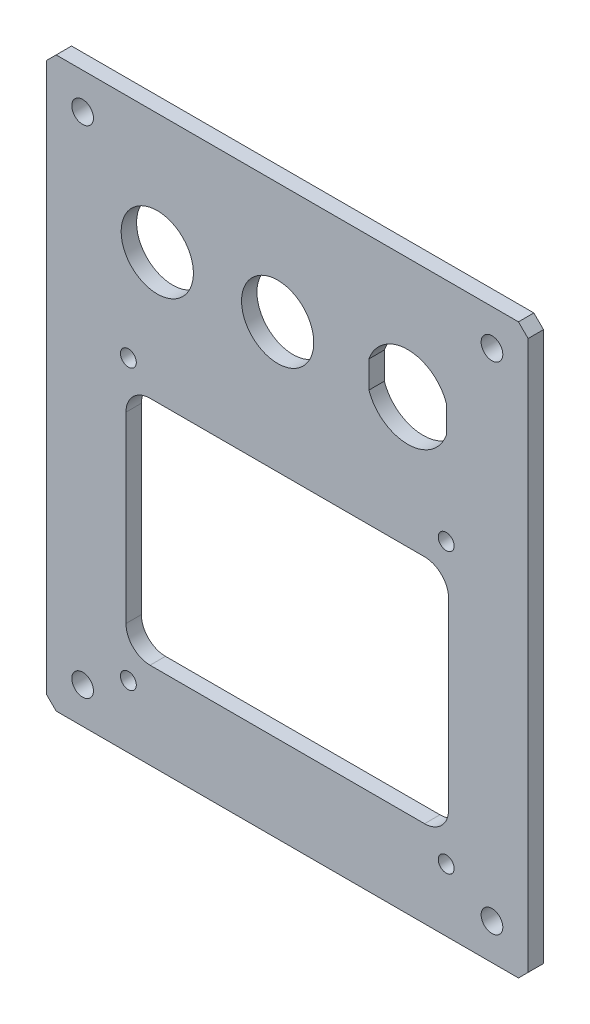
ISO-10303-21;
HEADER;
FILE_DESCRIPTION(('STEP AP214'),'2;1');
FILE_NAME('part.step','',(''),(''),'','','');
FILE_SCHEMA(('AUTOMOTIVE_DESIGN { 1 0 10303 214 1 1 1 1 }'));
ENDSEC;
DATA;
#1=APPLICATION_CONTEXT('core data for automotive mechanical design processes');
#2=APPLICATION_PROTOCOL_DEFINITION('international standard','automotive_design',2000,#1);
#3=PRODUCT_CONTEXT('',#1,'mechanical');
#4=PRODUCT('Part','Part','',(#3));
#5=PRODUCT_RELATED_PRODUCT_CATEGORY('part','',(#4));
#6=PRODUCT_DEFINITION_FORMATION('','',#4);
#7=PRODUCT_DEFINITION_CONTEXT('part definition',#1,'design');
#8=PRODUCT_DEFINITION('design','',#6,#7);
#9=PRODUCT_DEFINITION_SHAPE('','',#8);
#10=(LENGTH_UNIT() NAMED_UNIT(*) SI_UNIT(.MILLI.,.METRE.));
#11=(NAMED_UNIT(*) PLANE_ANGLE_UNIT() SI_UNIT($,.RADIAN.));
#12=(NAMED_UNIT(*) SI_UNIT($,.STERADIAN.) SOLID_ANGLE_UNIT());
#13=UNCERTAINTY_MEASURE_WITH_UNIT(LENGTH_MEASURE(1.E-05),#10,'distance_accuracy_value','');
#14=(GEOMETRIC_REPRESENTATION_CONTEXT(3) GLOBAL_UNCERTAINTY_ASSIGNED_CONTEXT((#13)) GLOBAL_UNIT_ASSIGNED_CONTEXT((#10,
#11,#12)) REPRESENTATION_CONTEXT('',''));
#15=CARTESIAN_POINT('',(0.,0.,0.));
#16=DIRECTION('',(0.,0.,1.));
#17=DIRECTION('',(1.,0.,0.));
#18=AXIS2_PLACEMENT_3D('',#15,#16,#17);
#19=CARTESIAN_POINT('',(0.,0.,1.2));
#20=DIRECTION('',(0.,0.,1.));
#21=DIRECTION('',(1.,0.,0.));
#22=AXIS2_PLACEMENT_3D('',#19,#20,#21);
#23=PLANE('',#22);
#24=CARTESIAN_POINT('',(-2.,34.,1.2));
#25=DIRECTION('',(0.,0.,-1.));
#26=DIRECTION('',(-1.,0.,0.));
#27=AXIS2_PLACEMENT_3D('',#24,#25,#26);
#28=CIRCLE('',#27,7.5);
#29=CARTESIAN_POINT('',(-9.5,34.,1.2));
#30=VERTEX_POINT('',#29);
#31=EDGE_CURVE('E265',#30,#30,#28,.F.);
#32=ORIENTED_EDGE('',*,*,#31,.T.);
#33=EDGE_LOOP('',(#32));
#34=FACE_BOUND('',#33,.T.);
#35=DIRECTION('',(1.,0.,0.));
#36=VECTOR('',#35,1.);
#37=CARTESIAN_POINT('',(-33.5,-41.,1.2));
#38=LINE('',#37,#36);
#39=CARTESIAN_POINT('',(-28.5,-41.,1.2));
#40=VERTEX_POINT('',#39);
#41=CARTESIAN_POINT('',(28.5,-41.,1.2));
#42=VERTEX_POINT('',#41);
#43=EDGE_CURVE('E174',#40,#42,#38,.T.);
#44=ORIENTED_EDGE('',*,*,#43,.T.);
#45=CARTESIAN_POINT('',(28.5,-36.,1.2));
#46=DIRECTION('',(0.,0.,-1.));
#47=DIRECTION('',(-1.,0.,0.));
#48=AXIS2_PLACEMENT_3D('',#45,#46,#47);
#49=CIRCLE('',#48,5.);
#50=CARTESIAN_POINT('',(33.5,-36.,1.2));
#51=VERTEX_POINT('',#50);
#52=EDGE_CURVE('E248',#42,#51,#49,.F.);
#53=ORIENTED_EDGE('',*,*,#52,.T.);
#54=DIRECTION('',(0.,1.,0.));
#55=VECTOR('',#54,1.);
#56=CARTESIAN_POINT('',(33.5,-41.,1.2));
#57=LINE('',#56,#55);
#58=CARTESIAN_POINT('',(33.5,2.,1.2));
#59=VERTEX_POINT('',#58);
#60=EDGE_CURVE('E178',#51,#59,#57,.T.);
#61=ORIENTED_EDGE('',*,*,#60,.T.);
#62=CARTESIAN_POINT('',(28.5,2.,1.2));
#63=DIRECTION('',(0.,0.,-1.));
#64=DIRECTION('',(-1.,0.,0.));
#65=AXIS2_PLACEMENT_3D('',#62,#63,#64);
#66=CIRCLE('',#65,5.);
#67=CARTESIAN_POINT('',(28.5,7.,1.2));
#68=VERTEX_POINT('',#67);
#69=EDGE_CURVE('E250',#59,#68,#66,.F.);
#70=ORIENTED_EDGE('',*,*,#69,.T.);
#71=DIRECTION('',(1.,0.,0.));
#72=VECTOR('',#71,1.);
#73=CARTESIAN_POINT('',(33.5,7.,1.2));
#74=LINE('',#73,#72);
#75=CARTESIAN_POINT('',(-28.5,7.,1.2));
#76=VERTEX_POINT('',#75);
#77=EDGE_CURVE('E182',#68,#76,#74,.F.);
#78=ORIENTED_EDGE('',*,*,#77,.T.);
#79=CARTESIAN_POINT('',(-28.5,2.,1.2));
#80=DIRECTION('',(0.,0.,-1.));
#81=DIRECTION('',(-1.,0.,0.));
#82=AXIS2_PLACEMENT_3D('',#79,#80,#81);
#83=CIRCLE('',#82,5.);
#84=CARTESIAN_POINT('',(-33.5,2.,1.2));
#85=VERTEX_POINT('',#84);
#86=EDGE_CURVE('E185',#76,#85,#83,.F.);
#87=ORIENTED_EDGE('',*,*,#86,.T.);
#88=DIRECTION('',(0.,1.,0.));
#89=VECTOR('',#88,1.);
#90=CARTESIAN_POINT('',(-33.5,7.,1.2));
#91=LINE('',#90,#89);
#92=CARTESIAN_POINT('',(-33.5,-36.,1.2));
#93=VERTEX_POINT('',#92);
#94=EDGE_CURVE('E171',#85,#93,#91,.F.);
#95=ORIENTED_EDGE('',*,*,#94,.T.);
#96=CARTESIAN_POINT('',(-28.5,-36.,1.2));
#97=DIRECTION('',(0.,0.,-1.));
#98=DIRECTION('',(-1.,0.,0.));
#99=AXIS2_PLACEMENT_3D('',#96,#97,#98);
#100=CIRCLE('',#99,5.);
#101=EDGE_CURVE('E246',#93,#40,#100,.F.);
#102=ORIENTED_EDGE('',*,*,#101,.T.);
#103=EDGE_LOOP('',(#44,#53,#61,#70,#78,#87,#95,#102));
#104=FACE_BOUND('',#103,.T.);
#105=CARTESIAN_POINT('',(33.,12.,1.2));
#106=DIRECTION('',(0.,0.,1.));
#107=DIRECTION('',(1.,0.,0.));
#108=AXIS2_PLACEMENT_3D('',#105,#106,#107);
#109=CIRCLE('',#108,1.65);
#110=CARTESIAN_POINT('',(34.65,12.,1.2));
#111=VERTEX_POINT('',#110);
#112=EDGE_CURVE('E253',#111,#111,#109,.T.);
#113=ORIENTED_EDGE('',*,*,#112,.T.);
#114=EDGE_LOOP('',(#113));
#115=FACE_BOUND('',#114,.T.);
#116=CARTESIAN_POINT('',(-33.,12.,1.2));
#117=DIRECTION('',(0.,0.,1.));
#118=DIRECTION('',(1.,0.,0.));
#119=AXIS2_PLACEMENT_3D('',#116,#117,#118);
#120=CIRCLE('',#119,1.65);
#121=CARTESIAN_POINT('',(-31.35,12.,1.2));
#122=VERTEX_POINT('',#121);
#123=EDGE_CURVE('E256',#122,#122,#120,.T.);
#124=ORIENTED_EDGE('',*,*,#123,.T.);
#125=EDGE_LOOP('',(#124));
#126=FACE_BOUND('',#125,.T.);
#127=CARTESIAN_POINT('',(-27.,34.,1.2));
#128=DIRECTION('',(0.,0.,-1.));
#129=DIRECTION('',(-1.,0.,0.));
#130=AXIS2_PLACEMENT_3D('',#127,#128,#129);
#131=CIRCLE('',#130,7.5);
#132=CARTESIAN_POINT('',(-34.5,34.,1.2));
#133=VERTEX_POINT('',#132);
#134=EDGE_CURVE('E268',#133,#133,#131,.F.);
#135=ORIENTED_EDGE('',*,*,#134,.T.);
#136=EDGE_LOOP('',(#135));
#137=FACE_BOUND('',#136,.T.);
#138=DIRECTION('',(0.,1.,0.));
#139=VECTOR('',#138,1.);
#140=CARTESIAN_POINT('',(33.05,31.19409105636,1.2));
#141=LINE('',#140,#139);
#142=CARTESIAN_POINT('',(33.05,31.1940910563599,1.2));
#143=VERTEX_POINT('',#142);
#144=CARTESIAN_POINT('',(33.05,36.8059089436401,1.2));
#145=VERTEX_POINT('',#144);
#146=EDGE_CURVE('E107',#143,#145,#141,.T.);
#147=ORIENTED_EDGE('',*,*,#146,.T.);
#148=CARTESIAN_POINT('',(25.,34.,1.2));
#149=DIRECTION('',(0.,0.,1.));
#150=DIRECTION('',(1.,0.,0.));
#151=AXIS2_PLACEMENT_3D('',#148,#149,#150);
#152=CIRCLE('',#151,8.525);
#153=CARTESIAN_POINT('',(16.95,36.8059089436401,1.2));
#154=VERTEX_POINT('',#153);
#155=EDGE_CURVE('E192',#145,#154,#152,.T.);
#156=ORIENTED_EDGE('',*,*,#155,.T.);
#157=DIRECTION('',(0.,1.,0.));
#158=VECTOR('',#157,1.);
#159=CARTESIAN_POINT('',(16.95,36.80590894364,1.2));
#160=LINE('',#159,#158);
#161=CARTESIAN_POINT('',(16.95,31.1940910563599,1.2));
#162=VERTEX_POINT('',#161);
#163=EDGE_CURVE('E186',#154,#162,#160,.F.);
#164=ORIENTED_EDGE('',*,*,#163,.T.);
#165=CARTESIAN_POINT('',(25.,34.,1.2));
#166=DIRECTION('',(0.,0.,1.));
#167=DIRECTION('',(1.,0.,0.));
#168=AXIS2_PLACEMENT_3D('',#165,#166,#167);
#169=CIRCLE('',#168,8.525);
#170=EDGE_CURVE('E272',#162,#143,#169,.T.);
#171=ORIENTED_EDGE('',*,*,#170,.T.);
#172=EDGE_LOOP('',(#147,#156,#164,#171));
#173=FACE_BOUND('',#172,.T.);
#174=CARTESIAN_POINT('',(33.,-46.,1.2));
#175=DIRECTION('',(0.,0.,1.));
#176=DIRECTION('',(1.,0.,0.));
#177=AXIS2_PLACEMENT_3D('',#174,#175,#176);
#178=CIRCLE('',#177,1.65);
#179=CARTESIAN_POINT('',(34.65,-46.,1.2));
#180=VERTEX_POINT('',#179);
#181=EDGE_CURVE('E259',#180,#180,#178,.T.);
#182=ORIENTED_EDGE('',*,*,#181,.T.);
#183=EDGE_LOOP('',(#182));
#184=FACE_BOUND('',#183,.T.);
#185=CARTESIAN_POINT('',(-33.,-46.,1.2));
#186=DIRECTION('',(0.,0.,1.));
#187=DIRECTION('',(1.,0.,0.));
#188=AXIS2_PLACEMENT_3D('',#185,#186,#187);
#189=CIRCLE('',#188,1.65);
#190=CARTESIAN_POINT('',(-31.35,-46.,1.2));
#191=VERTEX_POINT('',#190);
#192=EDGE_CURVE('E262',#191,#191,#189,.T.);
#193=ORIENTED_EDGE('',*,*,#192,.T.);
#194=EDGE_LOOP('',(#193));
#195=FACE_BOUND('',#194,.T.);
#196=CARTESIAN_POINT('',(-42.5,-51.5,1.2));
#197=DIRECTION('',(0.,0.,-1.));
#198=DIRECTION('',(-1.,0.,0.));
#199=AXIS2_PLACEMENT_3D('',#196,#197,#198);
#200=CIRCLE('',#199,2.25);
#201=CARTESIAN_POINT('',(-44.75,-51.5,1.2));
#202=VERTEX_POINT('',#201);
#203=EDGE_CURVE('E19',#202,#202,#200,.F.);
#204=ORIENTED_EDGE('',*,*,#203,.T.);
#205=EDGE_LOOP('',(#204));
#206=FACE_BOUND('',#205,.T.);
#207=CARTESIAN_POINT('',(42.5,-51.5,1.2));
#208=DIRECTION('',(0.,0.,-1.));
#209=DIRECTION('',(-1.,0.,0.));
#210=AXIS2_PLACEMENT_3D('',#207,#208,#209);
#211=CIRCLE('',#210,2.25);
#212=CARTESIAN_POINT('',(40.25,-51.5,1.2));
#213=VERTEX_POINT('',#212);
#214=EDGE_CURVE('E280',#213,#213,#211,.F.);
#215=ORIENTED_EDGE('',*,*,#214,.T.);
#216=EDGE_LOOP('',(#215));
#217=FACE_BOUND('',#216,.T.);
#218=CARTESIAN_POINT('',(-42.5,51.5,1.2));
#219=DIRECTION('',(0.,0.,-1.));
#220=DIRECTION('',(-1.,0.,0.));
#221=AXIS2_PLACEMENT_3D('',#218,#219,#220);
#222=CIRCLE('',#221,2.25);
#223=CARTESIAN_POINT('',(-44.75,51.5,1.2));
#224=VERTEX_POINT('',#223);
#225=EDGE_CURVE('E278',#224,#224,#222,.F.);
#226=ORIENTED_EDGE('',*,*,#225,.T.);
#227=EDGE_LOOP('',(#226));
#228=FACE_BOUND('',#227,.T.);
#229=CARTESIAN_POINT('',(42.5,51.5,1.2));
#230=DIRECTION('',(0.,0.,-1.));
#231=DIRECTION('',(-1.,0.,0.));
#232=AXIS2_PLACEMENT_3D('',#229,#230,#231);
#233=CIRCLE('',#232,2.25);
#234=CARTESIAN_POINT('',(40.25,51.5,1.2));
#235=VERTEX_POINT('',#234);
#236=EDGE_CURVE('E275',#235,#235,#233,.F.);
#237=ORIENTED_EDGE('',*,*,#236,.T.);
#238=EDGE_LOOP('',(#237));
#239=FACE_BOUND('',#238,.T.);
#240=DIRECTION('',(0.,1.,0.));
#241=VECTOR('',#240,1.);
#242=CARTESIAN_POINT('',(-50.,59.,1.2));
#243=LINE('',#242,#241);
#244=CARTESIAN_POINT('',(-50.,57.,1.2));
#245=VERTEX_POINT('',#244);
#246=CARTESIAN_POINT('',(-50.,-57.,1.2));
#247=VERTEX_POINT('',#246);
#248=EDGE_CURVE('E143',#245,#247,#243,.F.);
#249=ORIENTED_EDGE('',*,*,#248,.F.);
#250=DIRECTION('',(-0.707106781186548,-0.707106781186548,0.));
#251=VECTOR('',#250,1.);
#252=CARTESIAN_POINT('',(-49.,58.,1.2));
#253=LINE('',#252,#251);
#254=CARTESIAN_POINT('',(-48.,59.,1.2));
#255=VERTEX_POINT('',#254);
#256=EDGE_CURVE('E285',#255,#245,#253,.T.);
#257=ORIENTED_EDGE('',*,*,#256,.F.);
#258=DIRECTION('',(1.,0.,0.));
#259=VECTOR('',#258,1.);
#260=CARTESIAN_POINT('',(50.,59.,1.2));
#261=LINE('',#260,#259);
#262=CARTESIAN_POINT('',(48.,59.,1.2));
#263=VERTEX_POINT('',#262);
#264=EDGE_CURVE('E116',#263,#255,#261,.F.);
#265=ORIENTED_EDGE('',*,*,#264,.F.);
#266=DIRECTION('',(-0.707106781186548,0.707106781186548,0.));
#267=VECTOR('',#266,1.);
#268=CARTESIAN_POINT('',(49.,58.,1.2));
#269=LINE('',#268,#267);
#270=CARTESIAN_POINT('',(50.,57.,1.2));
#271=VERTEX_POINT('',#270);
#272=EDGE_CURVE('E300',#271,#263,#269,.T.);
#273=ORIENTED_EDGE('',*,*,#272,.F.);
#274=DIRECTION('',(0.,1.,0.));
#275=VECTOR('',#274,1.);
#276=CARTESIAN_POINT('',(50.,-59.,1.2));
#277=LINE('',#276,#275);
#278=CARTESIAN_POINT('',(50.,-57.,1.2));
#279=VERTEX_POINT('',#278);
#280=EDGE_CURVE('E305',#279,#271,#277,.T.);
#281=ORIENTED_EDGE('',*,*,#280,.F.);
#282=DIRECTION('',(0.707106781186548,0.707106781186548,0.));
#283=VECTOR('',#282,1.);
#284=CARTESIAN_POINT('',(49.,-58.,1.2));
#285=LINE('',#284,#283);
#286=CARTESIAN_POINT('',(48.,-59.,1.2));
#287=VERTEX_POINT('',#286);
#288=EDGE_CURVE('E310',#287,#279,#285,.T.);
#289=ORIENTED_EDGE('',*,*,#288,.F.);
#290=DIRECTION('',(1.,0.,0.));
#291=VECTOR('',#290,1.);
#292=CARTESIAN_POINT('',(-50.,-59.,1.2));
#293=LINE('',#292,#291);
#294=CARTESIAN_POINT('',(-48.,-59.,1.2));
#295=VERTEX_POINT('',#294);
#296=EDGE_CURVE('E158',#295,#287,#293,.T.);
#297=ORIENTED_EDGE('',*,*,#296,.F.);
#298=DIRECTION('',(0.707106781186548,-0.707106781186548,0.));
#299=VECTOR('',#298,1.);
#300=CARTESIAN_POINT('',(-49.,-58.,1.2));
#301=LINE('',#300,#299);
#302=EDGE_CURVE('E156',#247,#295,#301,.T.);
#303=ORIENTED_EDGE('',*,*,#302,.F.);
#304=EDGE_LOOP('',(#249,#257,#265,#273,#281,#289,#297,#303));
#305=FACE_BOUND('',#304,.T.);
#306=ADVANCED_FACE('F16',(#34,#104,#115,#126,#137,#173,#184,#195,#206,#217,#228,#239,#305),#23,.F.);
#307=CARTESIAN_POINT('',(-50.,59.,0.));
#308=DIRECTION('',(-1.,0.,0.));
#309=DIRECTION('',(0.,0.,1.));
#310=AXIS2_PLACEMENT_3D('',#307,#308,#309);
#311=PLANE('',#310);
#312=DIRECTION('',(0.,0.,1.));
#313=VECTOR('',#312,1.);
#314=CARTESIAN_POINT('',(-50.,57.,2.2));
#315=LINE('',#314,#313);
#316=CARTESIAN_POINT('',(-50.,57.,4.4));
#317=VERTEX_POINT('',#316);
#318=EDGE_CURVE('E151',#245,#317,#315,.T.);
#319=ORIENTED_EDGE('',*,*,#318,.F.);
#320=ORIENTED_EDGE('',*,*,#248,.T.);
#321=DIRECTION('',(0.,0.,1.));
#322=VECTOR('',#321,1.);
#323=CARTESIAN_POINT('',(-50.,-57.,2.2));
#324=LINE('',#323,#322);
#325=CARTESIAN_POINT('',(-50.,-57.,4.4));
#326=VERTEX_POINT('',#325);
#327=EDGE_CURVE('E148',#326,#247,#324,.F.);
#328=ORIENTED_EDGE('',*,*,#327,.F.);
#329=DIRECTION('',(0.,1.,0.));
#330=VECTOR('',#329,1.);
#331=CARTESIAN_POINT('',(-50.,0.,4.4));
#332=LINE('',#331,#330);
#333=EDGE_CURVE('E327',#317,#326,#332,.F.);
#334=ORIENTED_EDGE('',*,*,#333,.F.);
#335=EDGE_LOOP('',(#319,#320,#328,#334));
#336=FACE_BOUND('',#335,.T.);
#337=ADVANCED_FACE('F145',(#336),#311,.T.);
#338=CARTESIAN_POINT('',(-49.,-58.,2.2));
#339=DIRECTION('',(-0.707106781186548,-0.707106781186548,0.));
#340=DIRECTION('',(0.707106781186548,-0.707106781186548,0.));
#341=AXIS2_PLACEMENT_3D('',#338,#339,#340);
#342=PLANE('',#341);
#343=ORIENTED_EDGE('',*,*,#327,.T.);
#344=ORIENTED_EDGE('',*,*,#302,.T.);
#345=DIRECTION('',(0.,0.,-1.));
#346=VECTOR('',#345,1.);
#347=CARTESIAN_POINT('',(-48.,-59.,0.));
#348=LINE('',#347,#346);
#349=CARTESIAN_POINT('',(-48.,-59.,4.4));
#350=VERTEX_POINT('',#349);
#351=EDGE_CURVE('E162',#350,#295,#348,.T.);
#352=ORIENTED_EDGE('',*,*,#351,.F.);
#353=DIRECTION('',(0.707106781186548,-0.707106781186548,0.));
#354=VECTOR('',#353,1.);
#355=CARTESIAN_POINT('',(-50.,-57.,4.4));
#356=LINE('',#355,#354);
#357=EDGE_CURVE('E166',#326,#350,#356,.T.);
#358=ORIENTED_EDGE('',*,*,#357,.F.);
#359=EDGE_LOOP('',(#343,#344,#352,#358));
#360=FACE_BOUND('',#359,.T.);
#361=ADVANCED_FACE('F164',(#360),#342,.T.);
#362=CARTESIAN_POINT('',(-50.,-59.,0.));
#363=DIRECTION('',(0.,-1.,0.));
#364=DIRECTION('',(0.,0.,-1.));
#365=AXIS2_PLACEMENT_3D('',#362,#363,#364);
#366=PLANE('',#365);
#367=ORIENTED_EDGE('',*,*,#351,.T.);
#368=ORIENTED_EDGE('',*,*,#296,.T.);
#369=DIRECTION('',(0.,0.,1.));
#370=VECTOR('',#369,1.);
#371=CARTESIAN_POINT('',(48.,-59.,2.2));
#372=LINE('',#371,#370);
#373=CARTESIAN_POINT('',(48.,-59.,4.4));
#374=VERTEX_POINT('',#373);
#375=EDGE_CURVE('E312',#374,#287,#372,.F.);
#376=ORIENTED_EDGE('',*,*,#375,.F.);
#377=DIRECTION('',(1.,0.,0.));
#378=VECTOR('',#377,1.);
#379=CARTESIAN_POINT('',(0.,-59.,4.4));
#380=LINE('',#379,#378);
#381=EDGE_CURVE('E321',#350,#374,#380,.T.);
#382=ORIENTED_EDGE('',*,*,#381,.F.);
#383=EDGE_LOOP('',(#367,#368,#376,#382));
#384=FACE_BOUND('',#383,.T.);
#385=ADVANCED_FACE('F317',(#384),#366,.T.);
#386=CARTESIAN_POINT('',(49.,-58.,2.2));
#387=DIRECTION('',(0.707106781186548,-0.707106781186548,0.));
#388=DIRECTION('',(0.707106781186548,0.707106781186548,0.));
#389=AXIS2_PLACEMENT_3D('',#386,#387,#388);
#390=PLANE('',#389);
#391=ORIENTED_EDGE('',*,*,#375,.T.);
#392=ORIENTED_EDGE('',*,*,#288,.T.);
#393=DIRECTION('',(0.,0.,-1.));
#394=VECTOR('',#393,1.);
#395=CARTESIAN_POINT('',(50.,-57.,0.));
#396=LINE('',#395,#394);
#397=CARTESIAN_POINT('',(50.,-57.,4.4));
#398=VERTEX_POINT('',#397);
#399=EDGE_CURVE('E307',#398,#279,#396,.T.);
#400=ORIENTED_EDGE('',*,*,#399,.F.);
#401=DIRECTION('',(0.707106781186548,0.707106781186548,0.));
#402=VECTOR('',#401,1.);
#403=CARTESIAN_POINT('',(48.,-59.,4.4));
#404=LINE('',#403,#402);
#405=EDGE_CURVE('E349',#374,#398,#404,.T.);
#406=ORIENTED_EDGE('',*,*,#405,.F.);
#407=EDGE_LOOP('',(#391,#392,#400,#406));
#408=FACE_BOUND('',#407,.T.);
#409=ADVANCED_FACE('F618',(#408),#390,.T.);
#410=CARTESIAN_POINT('',(50.,-59.,0.));
#411=DIRECTION('',(1.,0.,0.));
#412=DIRECTION('',(0.,0.,-1.));
#413=AXIS2_PLACEMENT_3D('',#410,#411,#412);
#414=PLANE('',#413);
#415=ORIENTED_EDGE('',*,*,#399,.T.);
#416=ORIENTED_EDGE('',*,*,#280,.T.);
#417=DIRECTION('',(0.,0.,1.));
#418=VECTOR('',#417,1.);
#419=CARTESIAN_POINT('',(50.,57.,2.2));
#420=LINE('',#419,#418);
#421=CARTESIAN_POINT('',(50.,57.,4.4));
#422=VERTEX_POINT('',#421);
#423=EDGE_CURVE('E302',#422,#271,#420,.F.);
#424=ORIENTED_EDGE('',*,*,#423,.F.);
#425=DIRECTION('',(0.,1.,0.));
#426=VECTOR('',#425,1.);
#427=CARTESIAN_POINT('',(50.,0.,4.4));
#428=LINE('',#427,#426);
#429=EDGE_CURVE('E346',#398,#422,#428,.T.);
#430=ORIENTED_EDGE('',*,*,#429,.F.);
#431=EDGE_LOOP('',(#415,#416,#424,#430));
#432=FACE_BOUND('',#431,.T.);
#433=ADVANCED_FACE('F626',(#432),#414,.T.);
#434=CARTESIAN_POINT('',(49.,58.,2.2));
#435=DIRECTION('',(0.707106781186548,0.707106781186548,0.));
#436=DIRECTION('',(-0.707106781186548,0.707106781186548,0.));
#437=AXIS2_PLACEMENT_3D('',#434,#435,#436);
#438=PLANE('',#437);
#439=ORIENTED_EDGE('',*,*,#423,.T.);
#440=ORIENTED_EDGE('',*,*,#272,.T.);
#441=DIRECTION('',(0.,0.,1.));
#442=VECTOR('',#441,1.);
#443=CARTESIAN_POINT('',(48.,59.,0.));
#444=LINE('',#443,#442);
#445=CARTESIAN_POINT('',(48.,59.,4.4));
#446=VERTEX_POINT('',#445);
#447=EDGE_CURVE('E298',#446,#263,#444,.F.);
#448=ORIENTED_EDGE('',*,*,#447,.F.);
#449=DIRECTION('',(-0.707106781186548,0.707106781186548,0.));
#450=VECTOR('',#449,1.);
#451=CARTESIAN_POINT('',(50.,57.,4.4));
#452=LINE('',#451,#450);
#453=EDGE_CURVE('E340',#422,#446,#452,.T.);
#454=ORIENTED_EDGE('',*,*,#453,.F.);
#455=EDGE_LOOP('',(#439,#440,#448,#454));
#456=FACE_BOUND('',#455,.T.);
#457=ADVANCED_FACE('F635',(#456),#438,.T.);
#458=CARTESIAN_POINT('',(50.,59.,0.));
#459=DIRECTION('',(0.,1.,0.));
#460=DIRECTION('',(0.,0.,1.));
#461=AXIS2_PLACEMENT_3D('',#458,#459,#460);
#462=PLANE('',#461);
#463=ORIENTED_EDGE('',*,*,#447,.T.);
#464=ORIENTED_EDGE('',*,*,#264,.T.);
#465=DIRECTION('',(0.,0.,1.));
#466=VECTOR('',#465,1.);
#467=CARTESIAN_POINT('',(-48.,59.,2.2));
#468=LINE('',#467,#466);
#469=CARTESIAN_POINT('',(-48.,59.,4.4));
#470=VERTEX_POINT('',#469);
#471=EDGE_CURVE('E288',#470,#255,#468,.F.);
#472=ORIENTED_EDGE('',*,*,#471,.F.);
#473=DIRECTION('',(1.,0.,0.));
#474=VECTOR('',#473,1.);
#475=CARTESIAN_POINT('',(0.,59.,4.4));
#476=LINE('',#475,#474);
#477=EDGE_CURVE('E338',#446,#470,#476,.F.);
#478=ORIENTED_EDGE('',*,*,#477,.F.);
#479=EDGE_LOOP('',(#463,#464,#472,#478));
#480=FACE_BOUND('',#479,.T.);
#481=ADVANCED_FACE('F644',(#480),#462,.T.);
#482=CARTESIAN_POINT('',(-49.,58.,2.2));
#483=DIRECTION('',(-0.707106781186548,0.707106781186548,0.));
#484=DIRECTION('',(-0.707106781186548,-0.707106781186548,0.));
#485=AXIS2_PLACEMENT_3D('',#482,#483,#484);
#486=PLANE('',#485);
#487=ORIENTED_EDGE('',*,*,#471,.T.);
#488=ORIENTED_EDGE('',*,*,#256,.T.);
#489=ORIENTED_EDGE('',*,*,#318,.T.);
#490=DIRECTION('',(-0.707106781186548,-0.707106781186548,0.));
#491=VECTOR('',#490,1.);
#492=CARTESIAN_POINT('',(-48.,59.,4.4));
#493=LINE('',#492,#491);
#494=EDGE_CURVE('E245',#470,#317,#493,.T.);
#495=ORIENTED_EDGE('',*,*,#494,.F.);
#496=EDGE_LOOP('',(#487,#488,#489,#495));
#497=FACE_BOUND('',#496,.T.);
#498=ADVANCED_FACE('F333',(#497),#486,.T.);
#499=CARTESIAN_POINT('',(-42.5,-51.5,4.4));
#500=DIRECTION('',(0.,0.,-1.));
#501=DIRECTION('',(-1.,0.,0.));
#502=AXIS2_PLACEMENT_3D('',#499,#500,#501);
#503=CYLINDRICAL_SURFACE('',#502,2.25);
#504=CARTESIAN_POINT('',(-42.5,-51.5,4.4));
#505=DIRECTION('',(0.,0.,-1.));
#506=DIRECTION('',(-1.,0.,0.));
#507=AXIS2_PLACEMENT_3D('',#504,#505,#506);
#508=CIRCLE('',#507,2.25);
#509=CARTESIAN_POINT('',(-44.75,-51.5,4.4));
#510=VERTEX_POINT('',#509);
#511=EDGE_CURVE('E242',#510,#510,#508,.T.);
#512=ORIENTED_EDGE('',*,*,#511,.F.);
#513=EDGE_LOOP('',(#512));
#514=FACE_BOUND('',#513,.T.);
#515=ORIENTED_EDGE('',*,*,#203,.F.);
#516=EDGE_LOOP('',(#515));
#517=FACE_BOUND('',#516,.T.);
#518=ADVANCED_FACE('F660',(#514,#517),#503,.F.);
#519=CARTESIAN_POINT('',(42.5,-51.5,4.4));
#520=DIRECTION('',(0.,0.,-1.));
#521=DIRECTION('',(-1.,0.,0.));
#522=AXIS2_PLACEMENT_3D('',#519,#520,#521);
#523=CYLINDRICAL_SURFACE('',#522,2.25);
#524=CARTESIAN_POINT('',(42.5,-51.5,4.4));
#525=DIRECTION('',(0.,0.,-1.));
#526=DIRECTION('',(-1.,0.,0.));
#527=AXIS2_PLACEMENT_3D('',#524,#525,#526);
#528=CIRCLE('',#527,2.25);
#529=CARTESIAN_POINT('',(40.25,-51.5,4.4));
#530=VERTEX_POINT('',#529);
#531=EDGE_CURVE('E239',#530,#530,#528,.T.);
#532=ORIENTED_EDGE('',*,*,#531,.F.);
#533=EDGE_LOOP('',(#532));
#534=FACE_BOUND('',#533,.T.);
#535=ORIENTED_EDGE('',*,*,#214,.F.);
#536=EDGE_LOOP('',(#535));
#537=FACE_BOUND('',#536,.T.);
#538=ADVANCED_FACE('F409',(#534,#537),#523,.F.);
#539=CARTESIAN_POINT('',(-42.5,51.5,4.4));
#540=DIRECTION('',(0.,0.,-1.));
#541=DIRECTION('',(-1.,0.,0.));
#542=AXIS2_PLACEMENT_3D('',#539,#540,#541);
#543=CYLINDRICAL_SURFACE('',#542,2.25);
#544=ORIENTED_EDGE('',*,*,#225,.F.);
#545=EDGE_LOOP('',(#544));
#546=FACE_BOUND('',#545,.T.);
#547=CARTESIAN_POINT('',(-42.5,51.5,4.4));
#548=DIRECTION('',(0.,0.,-1.));
#549=DIRECTION('',(-1.,0.,0.));
#550=AXIS2_PLACEMENT_3D('',#547,#548,#549);
#551=CIRCLE('',#550,2.25);
#552=CARTESIAN_POINT('',(-44.75,51.5,4.4));
#553=VERTEX_POINT('',#552);
#554=EDGE_CURVE('E236',#553,#553,#551,.T.);
#555=ORIENTED_EDGE('',*,*,#554,.F.);
#556=EDGE_LOOP('',(#555));
#557=FACE_BOUND('',#556,.T.);
#558=ADVANCED_FACE('F399',(#546,#557),#543,.F.);
#559=CARTESIAN_POINT('',(42.5,51.5,4.4));
#560=DIRECTION('',(0.,0.,-1.));
#561=DIRECTION('',(-1.,0.,0.));
#562=AXIS2_PLACEMENT_3D('',#559,#560,#561);
#563=CYLINDRICAL_SURFACE('',#562,2.25);
#564=CARTESIAN_POINT('',(42.5,51.5,4.4));
#565=DIRECTION('',(0.,0.,-1.));
#566=DIRECTION('',(-1.,0.,0.));
#567=AXIS2_PLACEMENT_3D('',#564,#565,#566);
#568=CIRCLE('',#567,2.25);
#569=CARTESIAN_POINT('',(40.25,51.5,4.4));
#570=VERTEX_POINT('',#569);
#571=EDGE_CURVE('E233',#570,#570,#568,.T.);
#572=ORIENTED_EDGE('',*,*,#571,.F.);
#573=EDGE_LOOP('',(#572));
#574=FACE_BOUND('',#573,.T.);
#575=ORIENTED_EDGE('',*,*,#236,.F.);
#576=EDGE_LOOP('',(#575));
#577=FACE_BOUND('',#576,.T.);
#578=ADVANCED_FACE('F397',(#574,#577),#563,.F.);
#579=CARTESIAN_POINT('',(25.,34.,4.4));
#580=DIRECTION('',(0.,0.,1.));
#581=DIRECTION('',(1.,0.,0.));
#582=AXIS2_PLACEMENT_3D('',#579,#580,#581);
#583=CYLINDRICAL_SURFACE('',#582,8.525);
#584=CARTESIAN_POINT('',(25.,34.,4.4));
#585=DIRECTION('',(0.,0.,1.));
#586=DIRECTION('',(1.,0.,0.));
#587=AXIS2_PLACEMENT_3D('',#584,#585,#586);
#588=CIRCLE('',#587,8.525);
#589=CARTESIAN_POINT('',(16.95,36.8059089436401,4.4));
#590=VERTEX_POINT('',#589);
#591=CARTESIAN_POINT('',(33.05,36.8059089436401,4.4));
#592=VERTEX_POINT('',#591);
#593=EDGE_CURVE('E230',#590,#592,#588,.F.);
#594=ORIENTED_EDGE('',*,*,#593,.F.);
#595=DIRECTION('',(0.,0.,1.));
#596=VECTOR('',#595,1.);
#597=CARTESIAN_POINT('',(16.95,36.80590894364,4.4));
#598=LINE('',#597,#596);
#599=EDGE_CURVE('E271',#590,#154,#598,.F.);
#600=ORIENTED_EDGE('',*,*,#599,.T.);
#601=ORIENTED_EDGE('',*,*,#155,.F.);
#602=DIRECTION('',(0.,0.,-1.));
#603=VECTOR('',#602,1.);
#604=CARTESIAN_POINT('',(33.05,36.80590894364,4.4));
#605=LINE('',#604,#603);
#606=EDGE_CURVE('E191',#145,#592,#605,.F.);
#607=ORIENTED_EDGE('',*,*,#606,.T.);
#608=EDGE_LOOP('',(#594,#600,#601,#607));
#609=FACE_BOUND('',#608,.T.);
#610=ADVANCED_FACE('F382',(#609),#583,.F.);
#611=CARTESIAN_POINT('',(33.05,31.19409105636,4.4));
#612=DIRECTION('',(1.,0.,0.));
#613=DIRECTION('',(0.,0.,-1.));
#614=AXIS2_PLACEMENT_3D('',#611,#612,#613);
#615=PLANE('',#614);
#616=DIRECTION('',(0.,1.,0.));
#617=VECTOR('',#616,1.);
#618=CARTESIAN_POINT('',(33.05,0.,4.4));
#619=LINE('',#618,#617);
#620=CARTESIAN_POINT('',(33.05,31.1940910563599,4.4));
#621=VERTEX_POINT('',#620);
#622=EDGE_CURVE('E229',#592,#621,#619,.F.);
#623=ORIENTED_EDGE('',*,*,#622,.F.);
#624=ORIENTED_EDGE('',*,*,#606,.F.);
#625=ORIENTED_EDGE('',*,*,#146,.F.);
#626=DIRECTION('',(0.,0.,1.));
#627=VECTOR('',#626,1.);
#628=CARTESIAN_POINT('',(33.05,31.19409105636,4.4));
#629=LINE('',#628,#627);
#630=EDGE_CURVE('E189',#143,#621,#629,.T.);
#631=ORIENTED_EDGE('',*,*,#630,.T.);
#632=EDGE_LOOP('',(#623,#624,#625,#631));
#633=FACE_BOUND('',#632,.T.);
#634=ADVANCED_FACE('F369',(#633),#615,.F.);
#635=CARTESIAN_POINT('',(25.,34.,4.4));
#636=DIRECTION('',(0.,0.,1.));
#637=DIRECTION('',(1.,0.,0.));
#638=AXIS2_PLACEMENT_3D('',#635,#636,#637);
#639=CYLINDRICAL_SURFACE('',#638,8.525);
#640=CARTESIAN_POINT('',(25.,34.,4.4));
#641=DIRECTION('',(0.,0.,1.));
#642=DIRECTION('',(1.,0.,0.));
#643=AXIS2_PLACEMENT_3D('',#640,#641,#642);
#644=CIRCLE('',#643,8.525);
#645=CARTESIAN_POINT('',(16.95,31.1940910563599,4.4));
#646=VERTEX_POINT('',#645);
#647=EDGE_CURVE('E226',#621,#646,#644,.F.);
#648=ORIENTED_EDGE('',*,*,#647,.F.);
#649=ORIENTED_EDGE('',*,*,#630,.F.);
#650=ORIENTED_EDGE('',*,*,#170,.F.);
#651=DIRECTION('',(0.,0.,1.));
#652=VECTOR('',#651,1.);
#653=CARTESIAN_POINT('',(16.95,31.19409105636,4.4));
#654=LINE('',#653,#652);
#655=EDGE_CURVE('E188',#162,#646,#654,.T.);
#656=ORIENTED_EDGE('',*,*,#655,.T.);
#657=EDGE_LOOP('',(#648,#649,#650,#656));
#658=FACE_BOUND('',#657,.T.);
#659=ADVANCED_FACE('F374',(#658),#639,.F.);
#660=CARTESIAN_POINT('',(16.95,36.80590894364,4.4));
#661=DIRECTION('',(-1.,0.,0.));
#662=DIRECTION('',(0.,0.,1.));
#663=AXIS2_PLACEMENT_3D('',#660,#661,#662);
#664=PLANE('',#663);
#665=DIRECTION('',(0.,1.,0.));
#666=VECTOR('',#665,1.);
#667=CARTESIAN_POINT('',(16.95,0.,4.4));
#668=LINE('',#667,#666);
#669=EDGE_CURVE('E225',#646,#590,#668,.T.);
#670=ORIENTED_EDGE('',*,*,#669,.F.);
#671=ORIENTED_EDGE('',*,*,#655,.F.);
#672=ORIENTED_EDGE('',*,*,#163,.F.);
#673=ORIENTED_EDGE('',*,*,#599,.F.);
#674=EDGE_LOOP('',(#670,#671,#672,#673));
#675=FACE_BOUND('',#674,.T.);
#676=ADVANCED_FACE('F385',(#675),#664,.F.);
#677=CARTESIAN_POINT('',(-27.,34.,4.4));
#678=DIRECTION('',(0.,0.,-1.));
#679=DIRECTION('',(-1.,0.,0.));
#680=AXIS2_PLACEMENT_3D('',#677,#678,#679);
#681=CYLINDRICAL_SURFACE('',#680,7.5);
#682=CARTESIAN_POINT('',(-27.,34.,4.4));
#683=DIRECTION('',(0.,0.,-1.));
#684=DIRECTION('',(-1.,0.,0.));
#685=AXIS2_PLACEMENT_3D('',#682,#683,#684);
#686=CIRCLE('',#685,7.5);
#687=CARTESIAN_POINT('',(-34.5,34.,4.4));
#688=VERTEX_POINT('',#687);
#689=EDGE_CURVE('E222',#688,#688,#686,.T.);
#690=ORIENTED_EDGE('',*,*,#689,.F.);
#691=EDGE_LOOP('',(#690));
#692=FACE_BOUND('',#691,.T.);
#693=ORIENTED_EDGE('',*,*,#134,.F.);
#694=EDGE_LOOP('',(#693));
#695=FACE_BOUND('',#694,.T.);
#696=ADVANCED_FACE('F471',(#692,#695),#681,.F.);
#697=CARTESIAN_POINT('',(-2.,34.,4.4));
#698=DIRECTION('',(0.,0.,-1.));
#699=DIRECTION('',(-1.,0.,0.));
#700=AXIS2_PLACEMENT_3D('',#697,#698,#699);
#701=CYLINDRICAL_SURFACE('',#700,7.5);
#702=CARTESIAN_POINT('',(-2.,34.,4.4));
#703=DIRECTION('',(0.,0.,-1.));
#704=DIRECTION('',(-1.,0.,0.));
#705=AXIS2_PLACEMENT_3D('',#702,#703,#704);
#706=CIRCLE('',#705,7.5);
#707=CARTESIAN_POINT('',(-9.5,34.,4.4));
#708=VERTEX_POINT('',#707);
#709=EDGE_CURVE('E219',#708,#708,#706,.T.);
#710=ORIENTED_EDGE('',*,*,#709,.F.);
#711=EDGE_LOOP('',(#710));
#712=FACE_BOUND('',#711,.T.);
#713=ORIENTED_EDGE('',*,*,#31,.F.);
#714=EDGE_LOOP('',(#713));
#715=FACE_BOUND('',#714,.T.);
#716=ADVANCED_FACE('F467',(#712,#715),#701,.F.);
#717=CARTESIAN_POINT('',(-33.,-46.,-0.682));
#718=DIRECTION('',(0.,0.,1.));
#719=DIRECTION('',(1.,0.,0.));
#720=AXIS2_PLACEMENT_3D('',#717,#718,#719);
#721=CYLINDRICAL_SURFACE('',#720,1.65);
#722=CARTESIAN_POINT('',(-33.,-46.,4.4));
#723=DIRECTION('',(0.,0.,1.));
#724=DIRECTION('',(1.,0.,0.));
#725=AXIS2_PLACEMENT_3D('',#722,#723,#724);
#726=CIRCLE('',#725,1.65);
#727=CARTESIAN_POINT('',(-31.35,-46.,4.4));
#728=VERTEX_POINT('',#727);
#729=EDGE_CURVE('E216',#728,#728,#726,.F.);
#730=ORIENTED_EDGE('',*,*,#729,.F.);
#731=EDGE_LOOP('',(#730));
#732=FACE_BOUND('',#731,.T.);
#733=ORIENTED_EDGE('',*,*,#192,.F.);
#734=EDGE_LOOP('',(#733));
#735=FACE_BOUND('',#734,.T.);
#736=ADVANCED_FACE('F463',(#732,#735),#721,.F.);
#737=CARTESIAN_POINT('',(33.,-46.,-0.682));
#738=DIRECTION('',(0.,0.,1.));
#739=DIRECTION('',(1.,0.,0.));
#740=AXIS2_PLACEMENT_3D('',#737,#738,#739);
#741=CYLINDRICAL_SURFACE('',#740,1.65);
#742=CARTESIAN_POINT('',(33.,-46.,4.4));
#743=DIRECTION('',(0.,0.,1.));
#744=DIRECTION('',(1.,0.,0.));
#745=AXIS2_PLACEMENT_3D('',#742,#743,#744);
#746=CIRCLE('',#745,1.65);
#747=CARTESIAN_POINT('',(34.65,-46.,4.4));
#748=VERTEX_POINT('',#747);
#749=EDGE_CURVE('E213',#748,#748,#746,.F.);
#750=ORIENTED_EDGE('',*,*,#749,.F.);
#751=EDGE_LOOP('',(#750));
#752=FACE_BOUND('',#751,.T.);
#753=ORIENTED_EDGE('',*,*,#181,.F.);
#754=EDGE_LOOP('',(#753));
#755=FACE_BOUND('',#754,.T.);
#756=ADVANCED_FACE('F459',(#752,#755),#741,.F.);
#757=CARTESIAN_POINT('',(-33.,12.,-0.682));
#758=DIRECTION('',(0.,0.,1.));
#759=DIRECTION('',(1.,0.,0.));
#760=AXIS2_PLACEMENT_3D('',#757,#758,#759);
#761=CYLINDRICAL_SURFACE('',#760,1.65);
#762=CARTESIAN_POINT('',(-33.,12.,4.4));
#763=DIRECTION('',(0.,0.,1.));
#764=DIRECTION('',(1.,0.,0.));
#765=AXIS2_PLACEMENT_3D('',#762,#763,#764);
#766=CIRCLE('',#765,1.65);
#767=CARTESIAN_POINT('',(-31.35,12.,4.4));
#768=VERTEX_POINT('',#767);
#769=EDGE_CURVE('E210',#768,#768,#766,.F.);
#770=ORIENTED_EDGE('',*,*,#769,.F.);
#771=EDGE_LOOP('',(#770));
#772=FACE_BOUND('',#771,.T.);
#773=ORIENTED_EDGE('',*,*,#123,.F.);
#774=EDGE_LOOP('',(#773));
#775=FACE_BOUND('',#774,.T.);
#776=ADVANCED_FACE('F455',(#772,#775),#761,.F.);
#777=CARTESIAN_POINT('',(33.,12.,-0.682));
#778=DIRECTION('',(0.,0.,1.));
#779=DIRECTION('',(1.,0.,0.));
#780=AXIS2_PLACEMENT_3D('',#777,#778,#779);
#781=CYLINDRICAL_SURFACE('',#780,1.65);
#782=CARTESIAN_POINT('',(33.,12.,4.4));
#783=DIRECTION('',(0.,0.,1.));
#784=DIRECTION('',(1.,0.,0.));
#785=AXIS2_PLACEMENT_3D('',#782,#783,#784);
#786=CIRCLE('',#785,1.65);
#787=CARTESIAN_POINT('',(34.65,12.,4.4));
#788=VERTEX_POINT('',#787);
#789=EDGE_CURVE('E207',#788,#788,#786,.F.);
#790=ORIENTED_EDGE('',*,*,#789,.F.);
#791=EDGE_LOOP('',(#790));
#792=FACE_BOUND('',#791,.T.);
#793=ORIENTED_EDGE('',*,*,#112,.F.);
#794=EDGE_LOOP('',(#793));
#795=FACE_BOUND('',#794,.T.);
#796=ADVANCED_FACE('F451',(#792,#795),#781,.F.);
#797=CARTESIAN_POINT('',(-28.5,2.,10.85728));
#798=DIRECTION('',(0.,0.,-1.));
#799=DIRECTION('',(-1.,0.,0.));
#800=AXIS2_PLACEMENT_3D('',#797,#798,#799);
#801=CYLINDRICAL_SURFACE('',#800,5.);
#802=CARTESIAN_POINT('',(-28.5,2.,4.4));
#803=DIRECTION('',(0.,0.,-1.));
#804=DIRECTION('',(-1.,0.,0.));
#805=AXIS2_PLACEMENT_3D('',#802,#803,#804);
#806=CIRCLE('',#805,5.);
#807=CARTESIAN_POINT('',(-33.5,2.,4.4));
#808=VERTEX_POINT('',#807);
#809=CARTESIAN_POINT('',(-28.5,7.,4.4));
#810=VERTEX_POINT('',#809);
#811=EDGE_CURVE('E204',#808,#810,#806,.T.);
#812=ORIENTED_EDGE('',*,*,#811,.F.);
#813=DIRECTION('',(0.,0.,1.));
#814=VECTOR('',#813,1.);
#815=CARTESIAN_POINT('',(-33.5,2.,4.4));
#816=LINE('',#815,#814);
#817=EDGE_CURVE('E330',#808,#85,#816,.F.);
#818=ORIENTED_EDGE('',*,*,#817,.T.);
#819=ORIENTED_EDGE('',*,*,#86,.F.);
#820=DIRECTION('',(0.,0.,1.));
#821=VECTOR('',#820,1.);
#822=CARTESIAN_POINT('',(-28.5,7.,4.4));
#823=LINE('',#822,#821);
#824=EDGE_CURVE('E184',#76,#810,#823,.T.);
#825=ORIENTED_EDGE('',*,*,#824,.T.);
#826=EDGE_LOOP('',(#812,#818,#819,#825));
#827=FACE_BOUND('',#826,.T.);
#828=ADVANCED_FACE('F447',(#827),#801,.F.);
#829=CARTESIAN_POINT('',(33.5,7.,4.4));
#830=DIRECTION('',(0.,1.,0.));
#831=DIRECTION('',(0.,0.,1.));
#832=AXIS2_PLACEMENT_3D('',#829,#830,#831);
#833=PLANE('',#832);
#834=DIRECTION('',(1.,0.,0.));
#835=VECTOR('',#834,1.);
#836=CARTESIAN_POINT('',(0.,7.,4.4));
#837=LINE('',#836,#835);
#838=CARTESIAN_POINT('',(28.5,7.,4.4));
#839=VERTEX_POINT('',#838);
#840=EDGE_CURVE('E203',#810,#839,#837,.T.);
#841=ORIENTED_EDGE('',*,*,#840,.F.);
#842=ORIENTED_EDGE('',*,*,#824,.F.);
#843=ORIENTED_EDGE('',*,*,#77,.F.);
#844=DIRECTION('',(0.,0.,-1.));
#845=VECTOR('',#844,1.);
#846=CARTESIAN_POINT('',(28.5,7.,10.85728));
#847=LINE('',#846,#845);
#848=EDGE_CURVE('E181',#68,#839,#847,.F.);
#849=ORIENTED_EDGE('',*,*,#848,.T.);
#850=EDGE_LOOP('',(#841,#842,#843,#849));
#851=FACE_BOUND('',#850,.T.);
#852=ADVANCED_FACE('F443',(#851),#833,.F.);
#853=CARTESIAN_POINT('',(28.5,2.,10.85728));
#854=DIRECTION('',(0.,0.,-1.));
#855=DIRECTION('',(-1.,0.,0.));
#856=AXIS2_PLACEMENT_3D('',#853,#854,#855);
#857=CYLINDRICAL_SURFACE('',#856,5.);
#858=CARTESIAN_POINT('',(28.5,2.,4.4));
#859=DIRECTION('',(0.,0.,-1.));
#860=DIRECTION('',(-1.,0.,0.));
#861=AXIS2_PLACEMENT_3D('',#858,#859,#860);
#862=CIRCLE('',#861,5.);
#863=CARTESIAN_POINT('',(33.5,2.,4.4));
#864=VERTEX_POINT('',#863);
#865=EDGE_CURVE('E200',#839,#864,#862,.T.);
#866=ORIENTED_EDGE('',*,*,#865,.F.);
#867=ORIENTED_EDGE('',*,*,#848,.F.);
#868=ORIENTED_EDGE('',*,*,#69,.F.);
#869=DIRECTION('',(0.,0.,-1.));
#870=VECTOR('',#869,1.);
#871=CARTESIAN_POINT('',(33.5,2.,4.4));
#872=LINE('',#871,#870);
#873=EDGE_CURVE('E180',#59,#864,#872,.F.);
#874=ORIENTED_EDGE('',*,*,#873,.T.);
#875=EDGE_LOOP('',(#866,#867,#868,#874));
#876=FACE_BOUND('',#875,.T.);
#877=ADVANCED_FACE('F439',(#876),#857,.F.);
#878=CARTESIAN_POINT('',(33.5,-41.,4.4));
#879=DIRECTION('',(1.,0.,0.));
#880=DIRECTION('',(0.,0.,-1.));
#881=AXIS2_PLACEMENT_3D('',#878,#879,#880);
#882=PLANE('',#881);
#883=DIRECTION('',(0.,1.,0.));
#884=VECTOR('',#883,1.);
#885=CARTESIAN_POINT('',(33.5,0.,4.4));
#886=LINE('',#885,#884);
#887=CARTESIAN_POINT('',(33.5,-36.,4.4));
#888=VERTEX_POINT('',#887);
#889=EDGE_CURVE('E199',#864,#888,#886,.F.);
#890=ORIENTED_EDGE('',*,*,#889,.F.);
#891=ORIENTED_EDGE('',*,*,#873,.F.);
#892=ORIENTED_EDGE('',*,*,#60,.F.);
#893=DIRECTION('',(0.,0.,-1.));
#894=VECTOR('',#893,1.);
#895=CARTESIAN_POINT('',(33.5,-36.,10.85728));
#896=LINE('',#895,#894);
#897=EDGE_CURVE('E177',#51,#888,#896,.F.);
#898=ORIENTED_EDGE('',*,*,#897,.T.);
#899=EDGE_LOOP('',(#890,#891,#892,#898));
#900=FACE_BOUND('',#899,.T.);
#901=ADVANCED_FACE('F435',(#900),#882,.F.);
#902=CARTESIAN_POINT('',(28.5,-36.,10.85728));
#903=DIRECTION('',(0.,0.,-1.));
#904=DIRECTION('',(-1.,0.,0.));
#905=AXIS2_PLACEMENT_3D('',#902,#903,#904);
#906=CYLINDRICAL_SURFACE('',#905,5.);
#907=CARTESIAN_POINT('',(28.5,-36.,4.4));
#908=DIRECTION('',(0.,0.,-1.));
#909=DIRECTION('',(-1.,0.,0.));
#910=AXIS2_PLACEMENT_3D('',#907,#908,#909);
#911=CIRCLE('',#910,5.);
#912=CARTESIAN_POINT('',(28.5,-41.,4.4));
#913=VERTEX_POINT('',#912);
#914=EDGE_CURVE('E196',#888,#913,#911,.T.);
#915=ORIENTED_EDGE('',*,*,#914,.F.);
#916=ORIENTED_EDGE('',*,*,#897,.F.);
#917=ORIENTED_EDGE('',*,*,#52,.F.);
#918=DIRECTION('',(0.,0.,-1.));
#919=VECTOR('',#918,1.);
#920=CARTESIAN_POINT('',(28.5,-41.,4.4));
#921=LINE('',#920,#919);
#922=EDGE_CURVE('E176',#42,#913,#921,.F.);
#923=ORIENTED_EDGE('',*,*,#922,.T.);
#924=EDGE_LOOP('',(#915,#916,#917,#923));
#925=FACE_BOUND('',#924,.T.);
#926=ADVANCED_FACE('F431',(#925),#906,.F.);
#927=CARTESIAN_POINT('',(-33.5,-41.,4.4));
#928=DIRECTION('',(0.,-1.,0.));
#929=DIRECTION('',(0.,0.,-1.));
#930=AXIS2_PLACEMENT_3D('',#927,#928,#929);
#931=PLANE('',#930);
#932=DIRECTION('',(1.,0.,0.));
#933=VECTOR('',#932,1.);
#934=CARTESIAN_POINT('',(0.,-41.,4.4));
#935=LINE('',#934,#933);
#936=CARTESIAN_POINT('',(-28.5,-41.,4.4));
#937=VERTEX_POINT('',#936);
#938=EDGE_CURVE('E195',#913,#937,#935,.F.);
#939=ORIENTED_EDGE('',*,*,#938,.F.);
#940=ORIENTED_EDGE('',*,*,#922,.F.);
#941=ORIENTED_EDGE('',*,*,#43,.F.);
#942=DIRECTION('',(0.,0.,-1.));
#943=VECTOR('',#942,1.);
#944=CARTESIAN_POINT('',(-28.5,-41.,10.85728));
#945=LINE('',#944,#943);
#946=EDGE_CURVE('E173',#40,#937,#945,.F.);
#947=ORIENTED_EDGE('',*,*,#946,.T.);
#948=EDGE_LOOP('',(#939,#940,#941,#947));
#949=FACE_BOUND('',#948,.T.);
#950=ADVANCED_FACE('F428',(#949),#931,.F.);
#951=CARTESIAN_POINT('',(-28.5,-36.,10.85728));
#952=DIRECTION('',(0.,0.,-1.));
#953=DIRECTION('',(-1.,0.,0.));
#954=AXIS2_PLACEMENT_3D('',#951,#952,#953);
#955=CYLINDRICAL_SURFACE('',#954,5.);
#956=CARTESIAN_POINT('',(-28.5,-36.,4.4));
#957=DIRECTION('',(0.,0.,-1.));
#958=DIRECTION('',(-1.,0.,0.));
#959=AXIS2_PLACEMENT_3D('',#956,#957,#958);
#960=CIRCLE('',#959,5.);
#961=CARTESIAN_POINT('',(-33.5,-36.,4.4));
#962=VERTEX_POINT('',#961);
#963=EDGE_CURVE('E25',#937,#962,#960,.T.);
#964=ORIENTED_EDGE('',*,*,#963,.F.);
#965=ORIENTED_EDGE('',*,*,#946,.F.);
#966=ORIENTED_EDGE('',*,*,#101,.F.);
#967=DIRECTION('',(0.,0.,1.));
#968=VECTOR('',#967,1.);
#969=CARTESIAN_POINT('',(-33.5,-36.,4.4));
#970=LINE('',#969,#968);
#971=EDGE_CURVE('E34',#93,#962,#970,.T.);
#972=ORIENTED_EDGE('',*,*,#971,.T.);
#973=EDGE_LOOP('',(#964,#965,#966,#972));
#974=FACE_BOUND('',#973,.T.);
#975=ADVANCED_FACE('F421',(#974),#955,.F.);
#976=CARTESIAN_POINT('',(-33.5,7.,4.4));
#977=DIRECTION('',(-1.,0.,0.));
#978=DIRECTION('',(0.,0.,1.));
#979=AXIS2_PLACEMENT_3D('',#976,#977,#978);
#980=PLANE('',#979);
#981=DIRECTION('',(0.,1.,0.));
#982=VECTOR('',#981,1.);
#983=CARTESIAN_POINT('',(-33.5,0.,4.4));
#984=LINE('',#983,#982);
#985=EDGE_CURVE('E11',#962,#808,#984,.T.);
#986=ORIENTED_EDGE('',*,*,#985,.F.);
#987=ORIENTED_EDGE('',*,*,#971,.F.);
#988=ORIENTED_EDGE('',*,*,#94,.F.);
#989=ORIENTED_EDGE('',*,*,#817,.F.);
#990=EDGE_LOOP('',(#986,#987,#988,#989));
#991=FACE_BOUND('',#990,.T.);
#992=ADVANCED_FACE('F414',(#991),#980,.F.);
#993=CARTESIAN_POINT('',(0.,0.,4.4));
#994=DIRECTION('',(0.,0.,1.));
#995=DIRECTION('',(1.,0.,0.));
#996=AXIS2_PLACEMENT_3D('',#993,#994,#995);
#997=PLANE('',#996);
#998=ORIENTED_EDGE('',*,*,#963,.T.);
#999=ORIENTED_EDGE('',*,*,#985,.T.);
#1000=ORIENTED_EDGE('',*,*,#811,.T.);
#1001=ORIENTED_EDGE('',*,*,#840,.T.);
#1002=ORIENTED_EDGE('',*,*,#865,.T.);
#1003=ORIENTED_EDGE('',*,*,#889,.T.);
#1004=ORIENTED_EDGE('',*,*,#914,.T.);
#1005=ORIENTED_EDGE('',*,*,#938,.T.);
#1006=EDGE_LOOP('',(#998,#999,#1000,#1001,#1002,#1003,#1004,#1005));
#1007=FACE_BOUND('',#1006,.T.);
#1008=ORIENTED_EDGE('',*,*,#789,.T.);
#1009=EDGE_LOOP('',(#1008));
#1010=FACE_BOUND('',#1009,.T.);
#1011=ORIENTED_EDGE('',*,*,#769,.T.);
#1012=EDGE_LOOP('',(#1011));
#1013=FACE_BOUND('',#1012,.T.);
#1014=ORIENTED_EDGE('',*,*,#749,.T.);
#1015=EDGE_LOOP('',(#1014));
#1016=FACE_BOUND('',#1015,.T.);
#1017=ORIENTED_EDGE('',*,*,#729,.T.);
#1018=EDGE_LOOP('',(#1017));
#1019=FACE_BOUND('',#1018,.T.);
#1020=ORIENTED_EDGE('',*,*,#709,.T.);
#1021=EDGE_LOOP('',(#1020));
#1022=FACE_BOUND('',#1021,.T.);
#1023=ORIENTED_EDGE('',*,*,#689,.T.);
#1024=EDGE_LOOP('',(#1023));
#1025=FACE_BOUND('',#1024,.T.);
#1026=ORIENTED_EDGE('',*,*,#647,.T.);
#1027=ORIENTED_EDGE('',*,*,#669,.T.);
#1028=ORIENTED_EDGE('',*,*,#593,.T.);
#1029=ORIENTED_EDGE('',*,*,#622,.T.);
#1030=EDGE_LOOP('',(#1026,#1027,#1028,#1029));
#1031=FACE_BOUND('',#1030,.T.);
#1032=ORIENTED_EDGE('',*,*,#571,.T.);
#1033=EDGE_LOOP('',(#1032));
#1034=FACE_BOUND('',#1033,.T.);
#1035=ORIENTED_EDGE('',*,*,#554,.T.);
#1036=EDGE_LOOP('',(#1035));
#1037=FACE_BOUND('',#1036,.T.);
#1038=ORIENTED_EDGE('',*,*,#531,.T.);
#1039=EDGE_LOOP('',(#1038));
#1040=FACE_BOUND('',#1039,.T.);
#1041=ORIENTED_EDGE('',*,*,#511,.T.);
#1042=EDGE_LOOP('',(#1041));
#1043=FACE_BOUND('',#1042,.T.);
#1044=ORIENTED_EDGE('',*,*,#477,.T.);
#1045=ORIENTED_EDGE('',*,*,#494,.T.);
#1046=ORIENTED_EDGE('',*,*,#333,.T.);
#1047=ORIENTED_EDGE('',*,*,#357,.T.);
#1048=ORIENTED_EDGE('',*,*,#381,.T.);
#1049=ORIENTED_EDGE('',*,*,#405,.T.);
#1050=ORIENTED_EDGE('',*,*,#429,.T.);
#1051=ORIENTED_EDGE('',*,*,#453,.T.);
#1052=EDGE_LOOP('',(#1044,#1045,#1046,#1047,#1048,#1049,#1050,#1051));
#1053=FACE_BOUND('',#1052,.T.);
#1054=ADVANCED_FACE('F335',(#1007,#1010,#1013,#1016,#1019,#1022,#1025,#1031,#1034,#1037,#1040,
#1043,#1053),#997,.T.);
#1055=CLOSED_SHELL('',(#306,#337,#361,#385,#409,#433,#457,#481,#498,#518,#538,#558,#578,#610,
#634,#659,#676,#696,#716,#736,#756,#776,#796,#828,#852,#877,#901,#926,#950,#975,#992,#1054));
#1056=MANIFOLD_SOLID_BREP('B1',#1055);
#1057=ADVANCED_BREP_SHAPE_REPRESENTATION('',(#18,#1056),#14);
#1058=SHAPE_DEFINITION_REPRESENTATION(#9,#1057);
ENDSEC;
END-ISO-10303-21;
